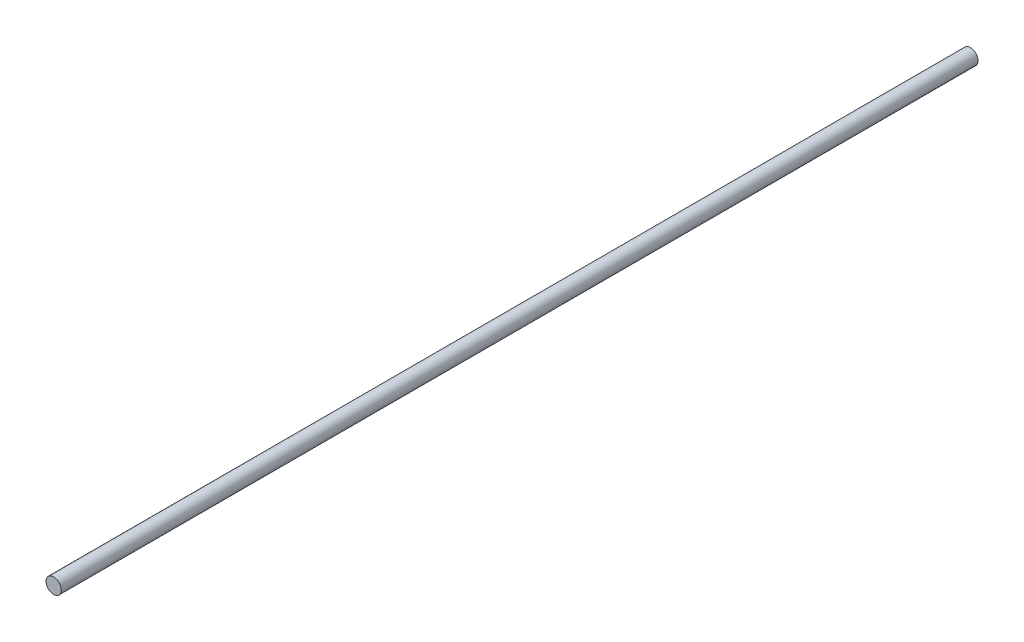
ISO-10303-21;
HEADER;
FILE_DESCRIPTION(('STEP AP214'),'2;1');
FILE_NAME('part.step','',(''),(''),'','','');
FILE_SCHEMA(('AUTOMOTIVE_DESIGN { 1 0 10303 214 1 1 1 1 }'));
ENDSEC;
DATA;
#1=APPLICATION_CONTEXT('core data for automotive mechanical design processes');
#2=APPLICATION_PROTOCOL_DEFINITION('international standard','automotive_design',2000,#1);
#3=PRODUCT_CONTEXT('',#1,'mechanical');
#4=PRODUCT('Part','Part','',(#3));
#5=PRODUCT_RELATED_PRODUCT_CATEGORY('part','',(#4));
#6=PRODUCT_DEFINITION_FORMATION('','',#4);
#7=PRODUCT_DEFINITION_CONTEXT('part definition',#1,'design');
#8=PRODUCT_DEFINITION('design','',#6,#7);
#9=PRODUCT_DEFINITION_SHAPE('','',#8);
#10=(LENGTH_UNIT() NAMED_UNIT(*) SI_UNIT(.MILLI.,.METRE.));
#11=(NAMED_UNIT(*) PLANE_ANGLE_UNIT() SI_UNIT($,.RADIAN.));
#12=(NAMED_UNIT(*) SI_UNIT($,.STERADIAN.) SOLID_ANGLE_UNIT());
#13=UNCERTAINTY_MEASURE_WITH_UNIT(LENGTH_MEASURE(1.E-05),#10,'distance_accuracy_value','');
#14=(GEOMETRIC_REPRESENTATION_CONTEXT(3) GLOBAL_UNCERTAINTY_ASSIGNED_CONTEXT((#13)) GLOBAL_UNIT_ASSIGNED_CONTEXT((#10,
#11,#12)) REPRESENTATION_CONTEXT('',''));
#15=CARTESIAN_POINT('',(0.,0.,0.));
#16=DIRECTION('',(0.,0.,1.));
#17=DIRECTION('',(1.,0.,0.));
#18=AXIS2_PLACEMENT_3D('',#15,#16,#17);
#19=CARTESIAN_POINT('',(0.,0.,180.));
#20=DIRECTION('',(0.,0.,-1.));
#21=DIRECTION('',(-1.,0.,0.));
#22=AXIS2_PLACEMENT_3D('',#19,#20,#21);
#23=CYLINDRICAL_SURFACE('',#22,1.5);
#24=CARTESIAN_POINT('',(0.,0.,180.));
#25=DIRECTION('',(0.,0.,1.));
#26=DIRECTION('',(1.,0.,0.));
#27=AXIS2_PLACEMENT_3D('',#24,#25,#26);
#28=CIRCLE('',#27,1.5);
#29=CARTESIAN_POINT('',(1.5,0.,180.));
#30=VERTEX_POINT('',#29);
#31=EDGE_CURVE('E10',#30,#30,#28,.T.);
#32=ORIENTED_EDGE('',*,*,#31,.F.);
#33=EDGE_LOOP('',(#32));
#34=FACE_BOUND('',#33,.T.);
#35=CARTESIAN_POINT('',(0.,0.,0.));
#36=DIRECTION('',(0.,0.,1.));
#37=DIRECTION('',(1.,0.,0.));
#38=AXIS2_PLACEMENT_3D('',#35,#36,#37);
#39=CIRCLE('',#38,1.5);
#40=CARTESIAN_POINT('',(1.5,0.,0.));
#41=VERTEX_POINT('',#40);
#42=EDGE_CURVE('E34',#41,#41,#39,.T.);
#43=ORIENTED_EDGE('',*,*,#42,.T.);
#44=EDGE_LOOP('',(#43));
#45=FACE_BOUND('',#44,.T.);
#46=ADVANCED_FACE('F31',(#34,#45),#23,.T.);
#47=CARTESIAN_POINT('',(0.,0.,180.));
#48=DIRECTION('',(0.,0.,1.));
#49=DIRECTION('',(1.,0.,0.));
#50=AXIS2_PLACEMENT_3D('',#47,#48,#49);
#51=PLANE('',#50);
#52=ORIENTED_EDGE('',*,*,#31,.T.);
#53=EDGE_LOOP('',(#52));
#54=FACE_BOUND('',#53,.T.);
#55=ADVANCED_FACE('F46',(#54),#51,.T.);
#56=CARTESIAN_POINT('',(0.,0.,0.));
#57=DIRECTION('',(0.,0.,1.));
#58=DIRECTION('',(1.,0.,0.));
#59=AXIS2_PLACEMENT_3D('',#56,#57,#58);
#60=PLANE('',#59);
#61=ORIENTED_EDGE('',*,*,#42,.F.);
#62=EDGE_LOOP('',(#61));
#63=FACE_BOUND('',#62,.T.);
#64=ADVANCED_FACE('F44',(#63),#60,.F.);
#65=CLOSED_SHELL('',(#46,#55,#64));
#66=MANIFOLD_SOLID_BREP('B2',#65);
#67=ADVANCED_BREP_SHAPE_REPRESENTATION('',(#18,#66),#14);
#68=SHAPE_DEFINITION_REPRESENTATION(#9,#67);
ENDSEC;
END-ISO-10303-21;
